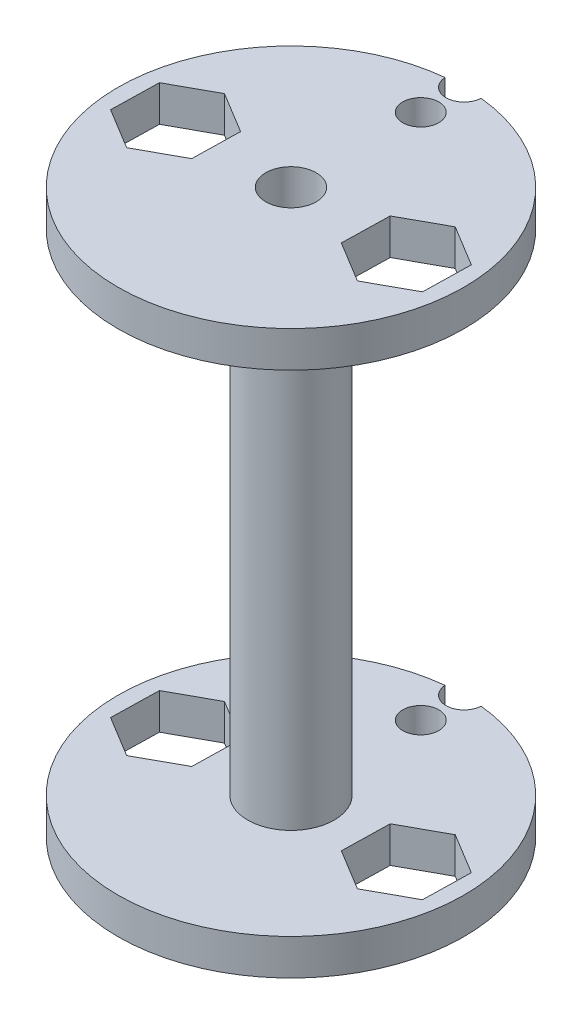
ISO-10303-21;
HEADER;
FILE_DESCRIPTION(('STEP AP214'),'2;1');
FILE_NAME('part.step','',(''),(''),'','','');
FILE_SCHEMA(('AUTOMOTIVE_DESIGN { 1 0 10303 214 1 1 1 1 }'));
ENDSEC;
DATA;
#1=APPLICATION_CONTEXT('core data for automotive mechanical design processes');
#2=APPLICATION_PROTOCOL_DEFINITION('international standard','automotive_design',2000,#1);
#3=PRODUCT_CONTEXT('',#1,'mechanical');
#4=PRODUCT('Part','Part','',(#3));
#5=PRODUCT_RELATED_PRODUCT_CATEGORY('part','',(#4));
#6=PRODUCT_DEFINITION_FORMATION('','',#4);
#7=PRODUCT_DEFINITION_CONTEXT('part definition',#1,'design');
#8=PRODUCT_DEFINITION('design','',#6,#7);
#9=PRODUCT_DEFINITION_SHAPE('','',#8);
#10=(LENGTH_UNIT() NAMED_UNIT(*) SI_UNIT(.MILLI.,.METRE.));
#11=(NAMED_UNIT(*) PLANE_ANGLE_UNIT() SI_UNIT($,.RADIAN.));
#12=(NAMED_UNIT(*) SI_UNIT($,.STERADIAN.) SOLID_ANGLE_UNIT());
#13=UNCERTAINTY_MEASURE_WITH_UNIT(LENGTH_MEASURE(1.E-05),#10,'distance_accuracy_value','');
#14=(GEOMETRIC_REPRESENTATION_CONTEXT(3) GLOBAL_UNCERTAINTY_ASSIGNED_CONTEXT((#13)) GLOBAL_UNIT_ASSIGNED_CONTEXT((#10,
#11,#12)) REPRESENTATION_CONTEXT('',''));
#15=CARTESIAN_POINT('',(0.,0.,0.));
#16=DIRECTION('',(0.,0.,1.));
#17=DIRECTION('',(1.,0.,0.));
#18=AXIS2_PLACEMENT_3D('',#15,#16,#17);
#19=CARTESIAN_POINT('',(0.,2.5,0.));
#20=DIRECTION('',(0.,1.,0.));
#21=DIRECTION('',(0.,0.,1.));
#22=AXIS2_PLACEMENT_3D('',#19,#20,#21);
#23=PLANE('',#22);
#24=DIRECTION('',(-0.0214869779830933,0.,0.999769128237692));
#25=VECTOR('',#24,1.);
#26=CARTESIAN_POINT('',(-5.08999790781407,2.5,-1.59772374233));
#27=LINE('',#26,#25);
#28=CARTESIAN_POINT('',(-5.08999790781407,2.5,-1.59772374233));
#29=VERTEX_POINT('',#28);
#30=CARTESIAN_POINT('',(-5.16132960481908,2.5,1.72127386573417));
#31=VERTEX_POINT('',#30);
#32=EDGE_CURVE('E412',#29,#31,#27,.T.);
#33=ORIENTED_EDGE('',*,*,#32,.T.);
#34=DIRECTION('',(-0.87656895196481,0.,0.48127629533493));
#35=VECTOR('',#34,1.);
#36=CARTESIAN_POINT('',(-5.16132960481908,2.5,1.72127386573417));
#37=LINE('',#36,#35);
#38=CARTESIAN_POINT('',(-8.07133169700495,2.5,3.31899760806487));
#39=VERTEX_POINT('',#38);
#40=EDGE_CURVE('E415',#31,#39,#37,.T.);
#41=ORIENTED_EDGE('',*,*,#40,.T.);
#42=DIRECTION('',(-0.855081973981716,0.,-0.518492832902762));
#43=VECTOR('',#42,1.);
#44=CARTESIAN_POINT('',(-8.07133169700495,2.5,3.31899760806487));
#45=LINE('',#44,#43);
#46=CARTESIAN_POINT('',(-10.9100020921858,2.5,1.59772374233139));
#47=VERTEX_POINT('',#46);
#48=EDGE_CURVE('E419',#39,#47,#45,.T.);
#49=ORIENTED_EDGE('',*,*,#48,.T.);
#50=DIRECTION('',(0.0214869779830943,0.,-0.999769128237692));
#51=VECTOR('',#50,1.);
#52=CARTESIAN_POINT('',(-10.9100020921858,2.5,1.59772374233139));
#53=LINE('',#52,#51);
#54=CARTESIAN_POINT('',(-10.8386703951808,2.5,-1.72127386573279));
#55=VERTEX_POINT('',#54);
#56=EDGE_CURVE('E422',#47,#55,#53,.T.);
#57=ORIENTED_EDGE('',*,*,#56,.T.);
#58=DIRECTION('',(0.87656895196481,0.,-0.48127629533493));
#59=VECTOR('',#58,1.);
#60=CARTESIAN_POINT('',(-10.8386703951808,2.5,-1.72127386573279));
#61=LINE('',#60,#59);
#62=CARTESIAN_POINT('',(-7.92866830299493,2.5,-3.31899760806348));
#63=VERTEX_POINT('',#62);
#64=EDGE_CURVE('E425',#55,#63,#61,.T.);
#65=ORIENTED_EDGE('',*,*,#64,.T.);
#66=DIRECTION('',(0.855081973981716,0.,0.518492832902762));
#67=VECTOR('',#66,1.);
#68=CARTESIAN_POINT('',(-7.92866830299493,2.5,-3.31899760806348));
#69=LINE('',#68,#67);
#70=EDGE_CURVE('E428',#63,#29,#69,.T.);
#71=ORIENTED_EDGE('',*,*,#70,.T.);
#72=EDGE_LOOP('',(#33,#41,#49,#57,#65,#71));
#73=FACE_BOUND('',#72,.T.);
#74=DIRECTION('',(0.0214869779832137,0.,-0.999769128237689));
#75=VECTOR('',#74,1.);
#76=CARTESIAN_POINT('',(5.089997907814,2.5,1.59772374233007));
#77=LINE('',#76,#75);
#78=CARTESIAN_POINT('',(5.089997907814,2.5,1.59772374233007));
#79=VERTEX_POINT('',#78);
#80=CARTESIAN_POINT('',(5.16132960481941,2.5,-1.72127386573409));
#81=VERTEX_POINT('',#80);
#82=EDGE_CURVE('E364',#79,#81,#77,.T.);
#83=ORIENTED_EDGE('',*,*,#82,.T.);
#84=DIRECTION('',(0.876568951964868,0.,-0.481276295334824));
#85=VECTOR('',#84,1.);
#86=CARTESIAN_POINT('',(5.16132960481941,2.5,-1.72127386573409));
#87=LINE('',#86,#85);
#88=CARTESIAN_POINT('',(8.07133169700547,2.5,-3.31899760806444));
#89=VERTEX_POINT('',#88);
#90=EDGE_CURVE('E367',#81,#89,#87,.T.);
#91=ORIENTED_EDGE('',*,*,#90,.T.);
#92=DIRECTION('',(0.855081973981654,0.,0.518492832902865));
#93=VECTOR('',#92,1.);
#94=CARTESIAN_POINT('',(8.07133169700547,2.5,-3.31899760806444));
#95=LINE('',#94,#93);
#96=CARTESIAN_POINT('',(10.9100020921861,2.5,-1.59772374233061));
#97=VERTEX_POINT('',#96);
#98=EDGE_CURVE('E60',#89,#97,#95,.T.);
#99=ORIENTED_EDGE('',*,*,#98,.T.);
#100=DIRECTION('',(-0.021486977983214,0.,0.999769128237689));
#101=VECTOR('',#100,1.);
#102=CARTESIAN_POINT('',(10.9100020921861,2.5,-1.59772374233061));
#103=LINE('',#102,#101);
#104=CARTESIAN_POINT('',(10.8386703951807,2.5,1.72127386573356));
#105=VERTEX_POINT('',#104);
#106=EDGE_CURVE('E372',#97,#105,#103,.T.);
#107=ORIENTED_EDGE('',*,*,#106,.T.);
#108=DIRECTION('',(-0.876568951964868,0.,0.481276295334824));
#109=VECTOR('',#108,1.);
#110=CARTESIAN_POINT('',(10.8386703951807,2.5,1.72127386573356));
#111=LINE('',#110,#109);
#112=CARTESIAN_POINT('',(7.92866830299465,2.5,3.3189976080639));
#113=VERTEX_POINT('',#112);
#114=EDGE_CURVE('E375',#105,#113,#111,.T.);
#115=ORIENTED_EDGE('',*,*,#114,.T.);
#116=DIRECTION('',(-0.855081973981654,0.,-0.518492832902865));
#117=VECTOR('',#116,1.);
#118=CARTESIAN_POINT('',(7.92866830299465,2.5,3.3189976080639));
#119=LINE('',#118,#117);
#120=EDGE_CURVE('E378',#113,#79,#119,.T.);
#121=ORIENTED_EDGE('',*,*,#120,.T.);
#122=EDGE_LOOP('',(#83,#91,#99,#107,#115,#121));
#123=FACE_BOUND('',#122,.T.);
#124=CARTESIAN_POINT('',(0.,2.5,-12.));
#125=DIRECTION('',(0.,1.,0.));
#126=DIRECTION('',(0.,0.,1.));
#127=AXIS2_PLACEMENT_3D('',#124,#125,#126);
#128=CIRCLE('',#127,1.25);
#129=CARTESIAN_POINT('',(-1.24830342764996,2.5,-11.9348958333333));
#130=VERTEX_POINT('',#129);
#131=CARTESIAN_POINT('',(1.24830342764996,2.5,-11.9348958333333));
#132=VERTEX_POINT('',#131);
#133=EDGE_CURVE('E358',#130,#132,#128,.T.);
#134=ORIENTED_EDGE('',*,*,#133,.F.);
#135=CARTESIAN_POINT('',(0.,2.5,0.));
#136=DIRECTION('',(0.,1.,0.));
#137=DIRECTION('',(0.,0.,1.));
#138=AXIS2_PLACEMENT_3D('',#135,#136,#137);
#139=CIRCLE('',#138,12.);
#140=EDGE_CURVE('E462',#130,#132,#139,.T.);
#141=ORIENTED_EDGE('',*,*,#140,.T.);
#142=EDGE_LOOP('',(#134,#141));
#143=FACE_BOUND('',#142,.T.);
#144=CARTESIAN_POINT('',(0.,2.5,-9.));
#145=DIRECTION('',(0.,1.,0.));
#146=DIRECTION('',(0.,0.,1.));
#147=AXIS2_PLACEMENT_3D('',#144,#145,#146);
#148=CIRCLE('',#147,1.25);
#149=CARTESIAN_POINT('',(0.,2.5,-7.75));
#150=VERTEX_POINT('',#149);
#151=EDGE_CURVE('E359',#150,#150,#148,.T.);
#152=ORIENTED_EDGE('',*,*,#151,.F.);
#153=EDGE_LOOP('',(#152));
#154=FACE_BOUND('',#153,.T.);
#155=CARTESIAN_POINT('',(0.,2.5,0.));
#156=DIRECTION('',(0.,1.,0.));
#157=DIRECTION('',(0.,0.,1.));
#158=AXIS2_PLACEMENT_3D('',#155,#156,#157);
#159=CIRCLE('',#158,3.);
#160=CARTESIAN_POINT('',(0.,2.5,3.));
#161=VERTEX_POINT('',#160);
#162=EDGE_CURVE('E232',#161,#161,#159,.T.);
#163=ORIENTED_EDGE('',*,*,#162,.F.);
#164=EDGE_LOOP('',(#163));
#165=FACE_BOUND('',#164,.T.);
#166=ADVANCED_FACE('F36',(#73,#123,#143,#154,#165),#23,.T.);
#167=CARTESIAN_POINT('',(0.,0.,0.));
#168=DIRECTION('',(0.,1.,0.));
#169=DIRECTION('',(0.,0.,1.));
#170=AXIS2_PLACEMENT_3D('',#167,#168,#169);
#171=PLANE('',#170);
#172=CARTESIAN_POINT('',(0.,0.,-9.));
#173=DIRECTION('',(0.,1.,0.));
#174=DIRECTION('',(0.,0.,1.));
#175=AXIS2_PLACEMENT_3D('',#172,#173,#174);
#176=CIRCLE('',#175,1.25);
#177=CARTESIAN_POINT('',(0.,0.,-7.75));
#178=VERTEX_POINT('',#177);
#179=EDGE_CURVE('E40',#178,#178,#176,.T.);
#180=ORIENTED_EDGE('',*,*,#179,.T.);
#181=EDGE_LOOP('',(#180));
#182=FACE_BOUND('',#181,.T.);
#183=DIRECTION('',(0.876568951964868,0.,-0.481276295334824));
#184=VECTOR('',#183,1.);
#185=CARTESIAN_POINT('',(5.16132960481941,0.,-1.72127386573409));
#186=LINE('',#185,#184);
#187=CARTESIAN_POINT('',(5.16132960481941,0.,-1.72127386573409));
#188=VERTEX_POINT('',#187);
#189=CARTESIAN_POINT('',(8.07133169700547,0.,-3.31899760806444));
#190=VERTEX_POINT('',#189);
#191=EDGE_CURVE('E384',#188,#190,#186,.T.);
#192=ORIENTED_EDGE('',*,*,#191,.F.);
#193=DIRECTION('',(0.0214869779832137,0.,-0.999769128237689));
#194=VECTOR('',#193,1.);
#195=CARTESIAN_POINT('',(5.089997907814,0.,1.59772374233007));
#196=LINE('',#195,#194);
#197=CARTESIAN_POINT('',(5.089997907814,0.,1.59772374233007));
#198=VERTEX_POINT('',#197);
#199=EDGE_CURVE('E382',#198,#188,#196,.T.);
#200=ORIENTED_EDGE('',*,*,#199,.F.);
#201=DIRECTION('',(-0.855081973981654,0.,-0.518492832902865));
#202=VECTOR('',#201,1.);
#203=CARTESIAN_POINT('',(7.92866830299465,0.,3.3189976080639));
#204=LINE('',#203,#202);
#205=CARTESIAN_POINT('',(7.92866830299465,0.,3.3189976080639));
#206=VERTEX_POINT('',#205);
#207=EDGE_CURVE('E368',#206,#198,#204,.T.);
#208=ORIENTED_EDGE('',*,*,#207,.F.);
#209=DIRECTION('',(-0.876568951964868,0.,0.481276295334824));
#210=VECTOR('',#209,1.);
#211=CARTESIAN_POINT('',(10.8386703951807,0.,1.72127386573356));
#212=LINE('',#211,#210);
#213=CARTESIAN_POINT('',(10.8386703951807,0.,1.72127386573356));
#214=VERTEX_POINT('',#213);
#215=EDGE_CURVE('E394',#214,#206,#212,.T.);
#216=ORIENTED_EDGE('',*,*,#215,.F.);
#217=DIRECTION('',(-0.021486977983214,0.,0.999769128237689));
#218=VECTOR('',#217,1.);
#219=CARTESIAN_POINT('',(10.9100020921861,0.,-1.59772374233061));
#220=LINE('',#219,#218);
#221=CARTESIAN_POINT('',(10.9100020921861,0.,-1.59772374233061));
#222=VERTEX_POINT('',#221);
#223=EDGE_CURVE('E391',#222,#214,#220,.T.);
#224=ORIENTED_EDGE('',*,*,#223,.F.);
#225=DIRECTION('',(0.855081973981654,0.,0.518492832902865));
#226=VECTOR('',#225,1.);
#227=CARTESIAN_POINT('',(8.07133169700547,0.,-3.31899760806444));
#228=LINE('',#227,#226);
#229=EDGE_CURVE('E388',#190,#222,#228,.T.);
#230=ORIENTED_EDGE('',*,*,#229,.F.);
#231=EDGE_LOOP('',(#192,#200,#208,#216,#224,#230));
#232=FACE_BOUND('',#231,.T.);
#233=DIRECTION('',(-0.87656895196481,0.,0.48127629533493));
#234=VECTOR('',#233,1.);
#235=CARTESIAN_POINT('',(-5.16132960481908,0.,1.72127386573417));
#236=LINE('',#235,#234);
#237=CARTESIAN_POINT('',(-5.16132960481908,0.,1.72127386573417));
#238=VERTEX_POINT('',#237);
#239=CARTESIAN_POINT('',(-8.07133169700495,0.,3.31899760806487));
#240=VERTEX_POINT('',#239);
#241=EDGE_CURVE('E434',#238,#240,#236,.T.);
#242=ORIENTED_EDGE('',*,*,#241,.F.);
#243=DIRECTION('',(-0.0214869779830933,0.,0.999769128237692));
#244=VECTOR('',#243,1.);
#245=CARTESIAN_POINT('',(-5.08999790781407,0.,-1.59772374233));
#246=LINE('',#245,#244);
#247=CARTESIAN_POINT('',(-5.08999790781407,0.,-1.59772374233));
#248=VERTEX_POINT('',#247);
#249=EDGE_CURVE('E432',#248,#238,#246,.T.);
#250=ORIENTED_EDGE('',*,*,#249,.F.);
#251=DIRECTION('',(0.855081973981716,0.,0.518492832902762));
#252=VECTOR('',#251,1.);
#253=CARTESIAN_POINT('',(-7.92866830299493,0.,-3.31899760806348));
#254=LINE('',#253,#252);
#255=CARTESIAN_POINT('',(-7.92866830299493,0.,-3.31899760806348));
#256=VERTEX_POINT('',#255);
#257=EDGE_CURVE('E416',#256,#248,#254,.T.);
#258=ORIENTED_EDGE('',*,*,#257,.F.);
#259=DIRECTION('',(0.87656895196481,0.,-0.48127629533493));
#260=VECTOR('',#259,1.);
#261=CARTESIAN_POINT('',(-10.8386703951808,0.,-1.72127386573279));
#262=LINE('',#261,#260);
#263=CARTESIAN_POINT('',(-10.8386703951808,0.,-1.72127386573279));
#264=VERTEX_POINT('',#263);
#265=EDGE_CURVE('E443',#264,#256,#262,.T.);
#266=ORIENTED_EDGE('',*,*,#265,.F.);
#267=DIRECTION('',(0.0214869779830943,0.,-0.999769128237692));
#268=VECTOR('',#267,1.);
#269=CARTESIAN_POINT('',(-10.9100020921858,0.,1.59772374233139));
#270=LINE('',#269,#268);
#271=CARTESIAN_POINT('',(-10.9100020921858,0.,1.59772374233139));
#272=VERTEX_POINT('',#271);
#273=EDGE_CURVE('E440',#272,#264,#270,.T.);
#274=ORIENTED_EDGE('',*,*,#273,.F.);
#275=DIRECTION('',(-0.855081973981716,0.,-0.518492832902762));
#276=VECTOR('',#275,1.);
#277=CARTESIAN_POINT('',(-8.07133169700495,0.,3.31899760806487));
#278=LINE('',#277,#276);
#279=EDGE_CURVE('E437',#240,#272,#278,.T.);
#280=ORIENTED_EDGE('',*,*,#279,.F.);
#281=EDGE_LOOP('',(#242,#250,#258,#266,#274,#280));
#282=FACE_BOUND('',#281,.T.);
#283=CARTESIAN_POINT('',(0.,0.,0.));
#284=DIRECTION('',(0.,1.,0.));
#285=DIRECTION('',(0.,0.,1.));
#286=AXIS2_PLACEMENT_3D('',#283,#284,#285);
#287=CIRCLE('',#286,12.);
#288=CARTESIAN_POINT('',(-1.24830342764996,0.,-11.9348958333333));
#289=VERTEX_POINT('',#288);
#290=CARTESIAN_POINT('',(1.24830342764998,0.,-11.9348958333333));
#291=VERTEX_POINT('',#290);
#292=EDGE_CURVE('E461',#289,#291,#287,.T.);
#293=ORIENTED_EDGE('',*,*,#292,.F.);
#294=CARTESIAN_POINT('',(0.,0.,-12.));
#295=DIRECTION('',(0.,1.,0.));
#296=DIRECTION('',(0.,0.,1.));
#297=AXIS2_PLACEMENT_3D('',#294,#295,#296);
#298=CIRCLE('',#297,1.25);
#299=EDGE_CURVE('E52',#289,#291,#298,.T.);
#300=ORIENTED_EDGE('',*,*,#299,.T.);
#301=EDGE_LOOP('',(#293,#300));
#302=FACE_BOUND('',#301,.T.);
#303=CARTESIAN_POINT('',(0.,0.,0.));
#304=DIRECTION('',(0.,1.,0.));
#305=DIRECTION('',(0.,0.,1.));
#306=AXIS2_PLACEMENT_3D('',#303,#304,#305);
#307=CIRCLE('',#306,1.75);
#308=CARTESIAN_POINT('',(0.,0.,1.75));
#309=VERTEX_POINT('',#308);
#310=EDGE_CURVE('E401',#309,#309,#307,.T.);
#311=ORIENTED_EDGE('',*,*,#310,.T.);
#312=EDGE_LOOP('',(#311));
#313=FACE_BOUND('',#312,.T.);
#314=ADVANCED_FACE('F472',(#182,#232,#282,#302,#313),#171,.F.);
#315=CARTESIAN_POINT('',(0.,2.5,0.));
#316=DIRECTION('',(0.,-1.,0.));
#317=DIRECTION('',(0.,0.,-1.));
#318=AXIS2_PLACEMENT_3D('',#315,#316,#317);
#319=CYLINDRICAL_SURFACE('',#318,12.);
#320=ORIENTED_EDGE('',*,*,#292,.T.);
#321=DIRECTION('',(0.,1.,0.));
#322=VECTOR('',#321,1.);
#323=CARTESIAN_POINT('',(1.24830342764996,0.,-11.9348958333333));
#324=LINE('',#323,#322);
#325=EDGE_CURVE('E11',#291,#132,#324,.T.);
#326=ORIENTED_EDGE('',*,*,#325,.T.);
#327=ORIENTED_EDGE('',*,*,#140,.F.);
#328=DIRECTION('',(0.,1.,0.));
#329=VECTOR('',#328,1.);
#330=CARTESIAN_POINT('',(-1.24830342764996,0.,-11.9348958333333));
#331=LINE('',#330,#329);
#332=EDGE_CURVE('E45',#130,#289,#331,.F.);
#333=ORIENTED_EDGE('',*,*,#332,.T.);
#334=EDGE_LOOP('',(#320,#326,#327,#333));
#335=FACE_BOUND('',#334,.T.);
#336=ADVANCED_FACE('F38',(#335),#319,.T.);
#337=CARTESIAN_POINT('',(0.,2.5,0.));
#338=DIRECTION('',(0.,-1.,0.));
#339=DIRECTION('',(0.,0.,-1.));
#340=AXIS2_PLACEMENT_3D('',#337,#338,#339);
#341=CYLINDRICAL_SURFACE('',#340,1.75);
#342=ORIENTED_EDGE('',*,*,#310,.F.);
#343=EDGE_LOOP('',(#342));
#344=FACE_BOUND('',#343,.T.);
#345=CARTESIAN_POINT('',(0.,39.,0.));
#346=DIRECTION('',(0.,1.,0.));
#347=DIRECTION('',(0.,0.,1.));
#348=AXIS2_PLACEMENT_3D('',#345,#346,#347);
#349=CIRCLE('',#348,1.75);
#350=CARTESIAN_POINT('',(0.,39.,1.75));
#351=VERTEX_POINT('',#350);
#352=EDGE_CURVE('E293',#351,#351,#349,.T.);
#353=ORIENTED_EDGE('',*,*,#352,.T.);
#354=EDGE_LOOP('',(#353));
#355=FACE_BOUND('',#354,.T.);
#356=ADVANCED_FACE('F478',(#344,#355),#341,.F.);
#357=CARTESIAN_POINT('',(-5.08999790781407,2.5,-1.59772374233));
#358=DIRECTION('',(0.999769128237692,0.,0.0214869779830933));
#359=DIRECTION('',(0.0214869779830933,0.,-0.999769128237692));
#360=AXIS2_PLACEMENT_3D('',#357,#358,#359);
#361=PLANE('',#360);
#362=ORIENTED_EDGE('',*,*,#249,.T.);
#363=DIRECTION('',(0.,-1.,0.));
#364=VECTOR('',#363,1.);
#365=CARTESIAN_POINT('',(-5.16132960481908,2.5,1.72127386573417));
#366=LINE('',#365,#364);
#367=EDGE_CURVE('E431',#31,#238,#366,.T.);
#368=ORIENTED_EDGE('',*,*,#367,.F.);
#369=ORIENTED_EDGE('',*,*,#32,.F.);
#370=DIRECTION('',(0.,-1.,0.));
#371=VECTOR('',#370,1.);
#372=CARTESIAN_POINT('',(-5.08999790781407,2.5,-1.59772374233));
#373=LINE('',#372,#371);
#374=EDGE_CURVE('E385',#29,#248,#373,.T.);
#375=ORIENTED_EDGE('',*,*,#374,.T.);
#376=EDGE_LOOP('',(#362,#368,#369,#375));
#377=FACE_BOUND('',#376,.T.);
#378=ADVANCED_FACE('F481',(#377),#361,.F.);
#379=CARTESIAN_POINT('',(-7.92866830299493,2.5,-3.31899760806348));
#380=DIRECTION('',(0.518492832902762,0.,-0.855081973981716));
#381=DIRECTION('',(-0.855081973981716,0.,-0.518492832902762));
#382=AXIS2_PLACEMENT_3D('',#379,#380,#381);
#383=PLANE('',#382);
#384=ORIENTED_EDGE('',*,*,#257,.T.);
#385=ORIENTED_EDGE('',*,*,#374,.F.);
#386=ORIENTED_EDGE('',*,*,#70,.F.);
#387=DIRECTION('',(0.,-1.,0.));
#388=VECTOR('',#387,1.);
#389=CARTESIAN_POINT('',(-7.92866830299493,2.5,-3.31899760806348));
#390=LINE('',#389,#388);
#391=EDGE_CURVE('E449',#63,#256,#390,.T.);
#392=ORIENTED_EDGE('',*,*,#391,.T.);
#393=EDGE_LOOP('',(#384,#385,#386,#392));
#394=FACE_BOUND('',#393,.T.);
#395=ADVANCED_FACE('F509',(#394),#383,.F.);
#396=CARTESIAN_POINT('',(-10.8386703951808,2.5,-1.72127386573279));
#397=DIRECTION('',(-0.48127629533493,0.,-0.87656895196481));
#398=DIRECTION('',(-0.87656895196481,0.,0.48127629533493));
#399=AXIS2_PLACEMENT_3D('',#396,#397,#398);
#400=PLANE('',#399);
#401=ORIENTED_EDGE('',*,*,#265,.T.);
#402=ORIENTED_EDGE('',*,*,#391,.F.);
#403=ORIENTED_EDGE('',*,*,#64,.F.);
#404=DIRECTION('',(0.,-1.,0.));
#405=VECTOR('',#404,1.);
#406=CARTESIAN_POINT('',(-10.8386703951808,2.5,-1.72127386573279));
#407=LINE('',#406,#405);
#408=EDGE_CURVE('E451',#55,#264,#407,.T.);
#409=ORIENTED_EDGE('',*,*,#408,.T.);
#410=EDGE_LOOP('',(#401,#402,#403,#409));
#411=FACE_BOUND('',#410,.T.);
#412=ADVANCED_FACE('F523',(#411),#400,.F.);
#413=CARTESIAN_POINT('',(-10.9100020921858,2.5,1.59772374233139));
#414=DIRECTION('',(-0.999769128237692,0.,-0.0214869779830943));
#415=DIRECTION('',(-0.0214869779830943,0.,0.999769128237692));
#416=AXIS2_PLACEMENT_3D('',#413,#414,#415);
#417=PLANE('',#416);
#418=ORIENTED_EDGE('',*,*,#273,.T.);
#419=ORIENTED_EDGE('',*,*,#408,.F.);
#420=ORIENTED_EDGE('',*,*,#56,.F.);
#421=DIRECTION('',(0.,-1.,0.));
#422=VECTOR('',#421,1.);
#423=CARTESIAN_POINT('',(-10.9100020921858,2.5,1.59772374233139));
#424=LINE('',#423,#422);
#425=EDGE_CURVE('E453',#47,#272,#424,.T.);
#426=ORIENTED_EDGE('',*,*,#425,.T.);
#427=EDGE_LOOP('',(#418,#419,#420,#426));
#428=FACE_BOUND('',#427,.T.);
#429=ADVANCED_FACE('F519',(#428),#417,.F.);
#430=CARTESIAN_POINT('',(-8.07133169700495,2.5,3.31899760806487));
#431=DIRECTION('',(-0.518492832902762,0.,0.855081973981716));
#432=DIRECTION('',(0.855081973981716,0.,0.518492832902762));
#433=AXIS2_PLACEMENT_3D('',#430,#431,#432);
#434=PLANE('',#433);
#435=ORIENTED_EDGE('',*,*,#279,.T.);
#436=ORIENTED_EDGE('',*,*,#425,.F.);
#437=ORIENTED_EDGE('',*,*,#48,.F.);
#438=DIRECTION('',(0.,-1.,0.));
#439=VECTOR('',#438,1.);
#440=CARTESIAN_POINT('',(-8.07133169700495,2.5,3.31899760806487));
#441=LINE('',#440,#439);
#442=EDGE_CURVE('E455',#39,#240,#441,.T.);
#443=ORIENTED_EDGE('',*,*,#442,.T.);
#444=EDGE_LOOP('',(#435,#436,#437,#443));
#445=FACE_BOUND('',#444,.T.);
#446=ADVANCED_FACE('F515',(#445),#434,.F.);
#447=CARTESIAN_POINT('',(-5.16132960481908,2.5,1.72127386573417));
#448=DIRECTION('',(0.48127629533493,0.,0.87656895196481));
#449=DIRECTION('',(0.87656895196481,0.,-0.48127629533493));
#450=AXIS2_PLACEMENT_3D('',#447,#448,#449);
#451=PLANE('',#450);
#452=ORIENTED_EDGE('',*,*,#241,.T.);
#453=ORIENTED_EDGE('',*,*,#442,.F.);
#454=ORIENTED_EDGE('',*,*,#40,.F.);
#455=ORIENTED_EDGE('',*,*,#367,.T.);
#456=EDGE_LOOP('',(#452,#453,#454,#455));
#457=FACE_BOUND('',#456,.T.);
#458=ADVANCED_FACE('F511',(#457),#451,.F.);
#459=CARTESIAN_POINT('',(5.089997907814,2.5,1.59772374233007));
#460=DIRECTION('',(-0.999769128237689,0.,-0.0214869779832137));
#461=DIRECTION('',(-0.0214869779832137,0.,0.999769128237689));
#462=AXIS2_PLACEMENT_3D('',#459,#460,#461);
#463=PLANE('',#462);
#464=ORIENTED_EDGE('',*,*,#199,.T.);
#465=DIRECTION('',(0.,-1.,0.));
#466=VECTOR('',#465,1.);
#467=CARTESIAN_POINT('',(5.16132960481941,2.5,-1.72127386573409));
#468=LINE('',#467,#466);
#469=EDGE_CURVE('E381',#81,#188,#468,.T.);
#470=ORIENTED_EDGE('',*,*,#469,.F.);
#471=ORIENTED_EDGE('',*,*,#82,.F.);
#472=DIRECTION('',(0.,-1.,0.));
#473=VECTOR('',#472,1.);
#474=CARTESIAN_POINT('',(5.089997907814,2.5,1.59772374233007));
#475=LINE('',#474,#473);
#476=EDGE_CURVE('E399',#79,#198,#475,.T.);
#477=ORIENTED_EDGE('',*,*,#476,.T.);
#478=EDGE_LOOP('',(#464,#470,#471,#477));
#479=FACE_BOUND('',#478,.T.);
#480=ADVANCED_FACE('F514',(#479),#463,.F.);
#481=CARTESIAN_POINT('',(7.92866830299465,2.5,3.3189976080639));
#482=DIRECTION('',(-0.518492832902865,0.,0.855081973981654));
#483=DIRECTION('',(0.855081973981654,0.,0.518492832902865));
#484=AXIS2_PLACEMENT_3D('',#481,#482,#483);
#485=PLANE('',#484);
#486=ORIENTED_EDGE('',*,*,#207,.T.);
#487=ORIENTED_EDGE('',*,*,#476,.F.);
#488=ORIENTED_EDGE('',*,*,#120,.F.);
#489=DIRECTION('',(0.,-1.,0.));
#490=VECTOR('',#489,1.);
#491=CARTESIAN_POINT('',(7.92866830299465,2.5,3.3189976080639));
#492=LINE('',#491,#490);
#493=EDGE_CURVE('E402',#113,#206,#492,.T.);
#494=ORIENTED_EDGE('',*,*,#493,.T.);
#495=EDGE_LOOP('',(#486,#487,#488,#494));
#496=FACE_BOUND('',#495,.T.);
#497=ADVANCED_FACE('F533',(#496),#485,.F.);
#498=CARTESIAN_POINT('',(10.8386703951807,2.5,1.72127386573356));
#499=DIRECTION('',(0.481276295334824,0.,0.876568951964868));
#500=DIRECTION('',(0.876568951964868,0.,-0.481276295334824));
#501=AXIS2_PLACEMENT_3D('',#498,#499,#500);
#502=PLANE('',#501);
#503=ORIENTED_EDGE('',*,*,#215,.T.);
#504=ORIENTED_EDGE('',*,*,#493,.F.);
#505=ORIENTED_EDGE('',*,*,#114,.F.);
#506=DIRECTION('',(0.,-1.,0.));
#507=VECTOR('',#506,1.);
#508=CARTESIAN_POINT('',(10.8386703951807,2.5,1.72127386573356));
#509=LINE('',#508,#507);
#510=EDGE_CURVE('E404',#105,#214,#509,.T.);
#511=ORIENTED_EDGE('',*,*,#510,.T.);
#512=EDGE_LOOP('',(#503,#504,#505,#511));
#513=FACE_BOUND('',#512,.T.);
#514=ADVANCED_FACE('F546',(#513),#502,.F.);
#515=CARTESIAN_POINT('',(10.9100020921861,2.5,-1.59772374233061));
#516=DIRECTION('',(0.999769128237689,0.,0.021486977983214));
#517=DIRECTION('',(0.021486977983214,0.,-0.999769128237689));
#518=AXIS2_PLACEMENT_3D('',#515,#516,#517);
#519=PLANE('',#518);
#520=ORIENTED_EDGE('',*,*,#223,.T.);
#521=ORIENTED_EDGE('',*,*,#510,.F.);
#522=ORIENTED_EDGE('',*,*,#106,.F.);
#523=DIRECTION('',(0.,-1.,0.));
#524=VECTOR('',#523,1.);
#525=CARTESIAN_POINT('',(10.9100020921861,2.5,-1.59772374233061));
#526=LINE('',#525,#524);
#527=EDGE_CURVE('E406',#97,#222,#526,.T.);
#528=ORIENTED_EDGE('',*,*,#527,.T.);
#529=EDGE_LOOP('',(#520,#521,#522,#528));
#530=FACE_BOUND('',#529,.T.);
#531=ADVANCED_FACE('F543',(#530),#519,.F.);
#532=CARTESIAN_POINT('',(8.07133169700547,2.5,-3.31899760806444));
#533=DIRECTION('',(0.518492832902865,0.,-0.855081973981654));
#534=DIRECTION('',(-0.855081973981654,0.,-0.518492832902865));
#535=AXIS2_PLACEMENT_3D('',#532,#533,#534);
#536=PLANE('',#535);
#537=ORIENTED_EDGE('',*,*,#229,.T.);
#538=ORIENTED_EDGE('',*,*,#527,.F.);
#539=ORIENTED_EDGE('',*,*,#98,.F.);
#540=DIRECTION('',(0.,-1.,0.));
#541=VECTOR('',#540,1.);
#542=CARTESIAN_POINT('',(8.07133169700547,2.5,-3.31899760806444));
#543=LINE('',#542,#541);
#544=EDGE_CURVE('E408',#89,#190,#543,.T.);
#545=ORIENTED_EDGE('',*,*,#544,.T.);
#546=EDGE_LOOP('',(#537,#538,#539,#545));
#547=FACE_BOUND('',#546,.T.);
#548=ADVANCED_FACE('F539',(#547),#536,.F.);
#549=CARTESIAN_POINT('',(5.16132960481941,2.5,-1.72127386573409));
#550=DIRECTION('',(-0.481276295334824,0.,-0.876568951964868));
#551=DIRECTION('',(-0.876568951964868,0.,0.481276295334825));
#552=AXIS2_PLACEMENT_3D('',#549,#550,#551);
#553=PLANE('',#552);
#554=ORIENTED_EDGE('',*,*,#191,.T.);
#555=ORIENTED_EDGE('',*,*,#544,.F.);
#556=ORIENTED_EDGE('',*,*,#90,.F.);
#557=ORIENTED_EDGE('',*,*,#469,.T.);
#558=EDGE_LOOP('',(#554,#555,#556,#557));
#559=FACE_BOUND('',#558,.T.);
#560=ADVANCED_FACE('F535',(#559),#553,.F.);
#561=CARTESIAN_POINT('',(0.,-2.5,-12.));
#562=DIRECTION('',(0.,1.,0.));
#563=DIRECTION('',(0.,0.,1.));
#564=AXIS2_PLACEMENT_3D('',#561,#562,#563);
#565=CYLINDRICAL_SURFACE('',#564,1.25);
#566=ORIENTED_EDGE('',*,*,#299,.F.);
#567=ORIENTED_EDGE('',*,*,#332,.F.);
#568=ORIENTED_EDGE('',*,*,#133,.T.);
#569=ORIENTED_EDGE('',*,*,#325,.F.);
#570=EDGE_LOOP('',(#566,#567,#568,#569));
#571=FACE_BOUND('',#570,.T.);
#572=ADVANCED_FACE('F538',(#571),#565,.F.);
#573=CARTESIAN_POINT('',(0.,-2.5,-9.));
#574=DIRECTION('',(0.,1.,0.));
#575=DIRECTION('',(0.,0.,1.));
#576=AXIS2_PLACEMENT_3D('',#573,#574,#575);
#577=CYLINDRICAL_SURFACE('',#576,1.25);
#578=ORIENTED_EDGE('',*,*,#151,.T.);
#579=EDGE_LOOP('',(#578));
#580=FACE_BOUND('',#579,.T.);
#581=ORIENTED_EDGE('',*,*,#179,.F.);
#582=EDGE_LOOP('',(#581));
#583=FACE_BOUND('',#582,.T.);
#584=ADVANCED_FACE('F556',(#580,#583),#577,.F.);
#585=CARTESIAN_POINT('',(0.,19.5,0.));
#586=DIRECTION('',(0.,-1.,0.));
#587=DIRECTION('',(0.,0.,-1.));
#588=AXIS2_PLACEMENT_3D('',#585,#586,#587);
#589=CYLINDRICAL_SURFACE('',#588,3.);
#590=ORIENTED_EDGE('',*,*,#162,.T.);
#591=EDGE_LOOP('',(#590));
#592=FACE_BOUND('',#591,.T.);
#593=CARTESIAN_POINT('',(0.,36.5,0.));
#594=DIRECTION('',(0.,1.,0.));
#595=DIRECTION('',(0.,0.,1.));
#596=AXIS2_PLACEMENT_3D('',#593,#594,#595);
#597=CIRCLE('',#596,3.);
#598=CARTESIAN_POINT('',(0.,36.5,3.));
#599=VERTEX_POINT('',#598);
#600=EDGE_CURVE('E244',#599,#599,#597,.T.);
#601=ORIENTED_EDGE('',*,*,#600,.F.);
#602=EDGE_LOOP('',(#601));
#603=FACE_BOUND('',#602,.T.);
#604=ADVANCED_FACE('F495',(#592,#603),#589,.T.);
#605=CARTESIAN_POINT('',(0.,36.5,0.));
#606=DIRECTION('',(0.,-1.,0.));
#607=DIRECTION('',(0.,0.,1.));
#608=AXIS2_PLACEMENT_3D('',#605,#606,#607);
#609=PLANE('',#608);
#610=DIRECTION('',(-0.0214869779830933,0.,0.999769128237692));
#611=VECTOR('',#610,1.);
#612=CARTESIAN_POINT('',(-5.08999790781407,36.5,-1.59772374233));
#613=LINE('',#612,#611);
#614=CARTESIAN_POINT('',(-5.08999790781407,36.5,-1.59772374233));
#615=VERTEX_POINT('',#614);
#616=CARTESIAN_POINT('',(-5.16132960481908,36.5,1.72127386573417));
#617=VERTEX_POINT('',#616);
#618=EDGE_CURVE('E303',#615,#617,#613,.T.);
#619=ORIENTED_EDGE('',*,*,#618,.F.);
#620=DIRECTION('',(0.855081973981716,0.,0.518492832902762));
#621=VECTOR('',#620,1.);
#622=CARTESIAN_POINT('',(-7.92866830299493,36.5,-3.31899760806348));
#623=LINE('',#622,#621);
#624=CARTESIAN_POINT('',(-7.92866830299493,36.5,-3.31899760806348));
#625=VERTEX_POINT('',#624);
#626=EDGE_CURVE('E319',#625,#615,#623,.T.);
#627=ORIENTED_EDGE('',*,*,#626,.F.);
#628=DIRECTION('',(0.87656895196481,0.,-0.48127629533493));
#629=VECTOR('',#628,1.);
#630=CARTESIAN_POINT('',(-10.8386703951808,36.5,-1.72127386573279));
#631=LINE('',#630,#629);
#632=CARTESIAN_POINT('',(-10.8386703951808,36.5,-1.72127386573279));
#633=VERTEX_POINT('',#632);
#634=EDGE_CURVE('E316',#633,#625,#631,.T.);
#635=ORIENTED_EDGE('',*,*,#634,.F.);
#636=DIRECTION('',(0.0214869779830943,0.,-0.999769128237692));
#637=VECTOR('',#636,1.);
#638=CARTESIAN_POINT('',(-10.9100020921858,36.5,1.59772374233139));
#639=LINE('',#638,#637);
#640=CARTESIAN_POINT('',(-10.9100020921858,36.5,1.59772374233139));
#641=VERTEX_POINT('',#640);
#642=EDGE_CURVE('E313',#641,#633,#639,.T.);
#643=ORIENTED_EDGE('',*,*,#642,.F.);
#644=DIRECTION('',(-0.855081973981716,0.,-0.518492832902762));
#645=VECTOR('',#644,1.);
#646=CARTESIAN_POINT('',(-8.07133169700495,36.5,3.31899760806487));
#647=LINE('',#646,#645);
#648=CARTESIAN_POINT('',(-8.07133169700495,36.5,3.31899760806487));
#649=VERTEX_POINT('',#648);
#650=EDGE_CURVE('E310',#649,#641,#647,.T.);
#651=ORIENTED_EDGE('',*,*,#650,.F.);
#652=DIRECTION('',(-0.87656895196481,0.,0.48127629533493));
#653=VECTOR('',#652,1.);
#654=CARTESIAN_POINT('',(-5.16132960481908,36.5,1.72127386573417));
#655=LINE('',#654,#653);
#656=EDGE_CURVE('E306',#617,#649,#655,.T.);
#657=ORIENTED_EDGE('',*,*,#656,.F.);
#658=EDGE_LOOP('',(#619,#627,#635,#643,#651,#657));
#659=FACE_BOUND('',#658,.T.);
#660=DIRECTION('',(0.0214869779832137,0.,-0.999769128237689));
#661=VECTOR('',#660,1.);
#662=CARTESIAN_POINT('',(5.089997907814,36.5,1.59772374233007));
#663=LINE('',#662,#661);
#664=CARTESIAN_POINT('',(5.089997907814,36.5,1.59772374233007));
#665=VERTEX_POINT('',#664);
#666=CARTESIAN_POINT('',(5.16132960481941,36.5,-1.72127386573409));
#667=VERTEX_POINT('',#666);
#668=EDGE_CURVE('E253',#665,#667,#663,.T.);
#669=ORIENTED_EDGE('',*,*,#668,.F.);
#670=DIRECTION('',(-0.855081973981654,0.,-0.518492832902865));
#671=VECTOR('',#670,1.);
#672=CARTESIAN_POINT('',(7.92866830299465,36.5,3.3189976080639));
#673=LINE('',#672,#671);
#674=CARTESIAN_POINT('',(7.92866830299465,36.5,3.3189976080639));
#675=VERTEX_POINT('',#674);
#676=EDGE_CURVE('E269',#675,#665,#673,.T.);
#677=ORIENTED_EDGE('',*,*,#676,.F.);
#678=DIRECTION('',(-0.876568951964868,0.,0.481276295334824));
#679=VECTOR('',#678,1.);
#680=CARTESIAN_POINT('',(10.8386703951807,36.5,1.72127386573356));
#681=LINE('',#680,#679);
#682=CARTESIAN_POINT('',(10.8386703951807,36.5,1.72127386573356));
#683=VERTEX_POINT('',#682);
#684=EDGE_CURVE('E266',#683,#675,#681,.T.);
#685=ORIENTED_EDGE('',*,*,#684,.F.);
#686=DIRECTION('',(-0.021486977983214,0.,0.999769128237689));
#687=VECTOR('',#686,1.);
#688=CARTESIAN_POINT('',(10.9100020921861,36.5,-1.59772374233061));
#689=LINE('',#688,#687);
#690=CARTESIAN_POINT('',(10.9100020921861,36.5,-1.59772374233061));
#691=VERTEX_POINT('',#690);
#692=EDGE_CURVE('E263',#691,#683,#689,.T.);
#693=ORIENTED_EDGE('',*,*,#692,.F.);
#694=DIRECTION('',(0.855081973981654,0.,0.518492832902865));
#695=VECTOR('',#694,1.);
#696=CARTESIAN_POINT('',(8.07133169700547,36.5,-3.31899760806444));
#697=LINE('',#696,#695);
#698=CARTESIAN_POINT('',(8.07133169700547,36.5,-3.31899760806444));
#699=VERTEX_POINT('',#698);
#700=EDGE_CURVE('E260',#699,#691,#697,.T.);
#701=ORIENTED_EDGE('',*,*,#700,.F.);
#702=DIRECTION('',(0.876568951964868,0.,-0.481276295334824));
#703=VECTOR('',#702,1.);
#704=CARTESIAN_POINT('',(5.16132960481941,36.5,-1.72127386573409));
#705=LINE('',#704,#703);
#706=EDGE_CURVE('E256',#667,#699,#705,.T.);
#707=ORIENTED_EDGE('',*,*,#706,.F.);
#708=EDGE_LOOP('',(#669,#677,#685,#693,#701,#707));
#709=FACE_BOUND('',#708,.T.);
#710=CARTESIAN_POINT('',(0.,36.5,-12.));
#711=DIRECTION('',(0.,1.,0.));
#712=DIRECTION('',(0.,0.,1.));
#713=AXIS2_PLACEMENT_3D('',#710,#711,#712);
#714=CIRCLE('',#713,1.25);
#715=CARTESIAN_POINT('',(-1.24830342764996,36.5,-11.9348958333333));
#716=VERTEX_POINT('',#715);
#717=CARTESIAN_POINT('',(1.24830342764996,36.5,-11.9348958333333));
#718=VERTEX_POINT('',#717);
#719=EDGE_CURVE('E226',#716,#718,#714,.T.);
#720=ORIENTED_EDGE('',*,*,#719,.T.);
#721=CARTESIAN_POINT('',(0.,36.5,0.));
#722=DIRECTION('',(0.,1.,0.));
#723=DIRECTION('',(0.,0.,1.));
#724=AXIS2_PLACEMENT_3D('',#721,#722,#723);
#725=CIRCLE('',#724,12.);
#726=EDGE_CURVE('E236',#716,#718,#725,.T.);
#727=ORIENTED_EDGE('',*,*,#726,.F.);
#728=EDGE_LOOP('',(#720,#727));
#729=FACE_BOUND('',#728,.T.);
#730=CARTESIAN_POINT('',(0.,36.5,-9.));
#731=DIRECTION('',(0.,1.,0.));
#732=DIRECTION('',(0.,0.,1.));
#733=AXIS2_PLACEMENT_3D('',#730,#731,#732);
#734=CIRCLE('',#733,1.25);
#735=CARTESIAN_POINT('',(0.,36.5,-7.75));
#736=VERTEX_POINT('',#735);
#737=EDGE_CURVE('E243',#736,#736,#734,.T.);
#738=ORIENTED_EDGE('',*,*,#737,.T.);
#739=EDGE_LOOP('',(#738));
#740=FACE_BOUND('',#739,.T.);
#741=ORIENTED_EDGE('',*,*,#600,.T.);
#742=EDGE_LOOP('',(#741));
#743=FACE_BOUND('',#742,.T.);
#744=ADVANCED_FACE('F241',(#659,#709,#729,#740,#743),#609,.T.);
#745=CARTESIAN_POINT('',(0.,39.,0.));
#746=DIRECTION('',(0.,-1.,0.));
#747=DIRECTION('',(0.,0.,1.));
#748=AXIS2_PLACEMENT_3D('',#745,#746,#747);
#749=PLANE('',#748);
#750=CARTESIAN_POINT('',(0.,39.,-9.));
#751=DIRECTION('',(0.,1.,0.));
#752=DIRECTION('',(0.,0.,1.));
#753=AXIS2_PLACEMENT_3D('',#750,#751,#752);
#754=CIRCLE('',#753,1.25);
#755=CARTESIAN_POINT('',(0.,39.,-7.75));
#756=VERTEX_POINT('',#755);
#757=EDGE_CURVE('E252',#756,#756,#754,.T.);
#758=ORIENTED_EDGE('',*,*,#757,.F.);
#759=EDGE_LOOP('',(#758));
#760=FACE_BOUND('',#759,.T.);
#761=DIRECTION('',(0.876568951964868,0.,-0.481276295334824));
#762=VECTOR('',#761,1.);
#763=CARTESIAN_POINT('',(5.16132960481941,39.,-1.72127386573409));
#764=LINE('',#763,#762);
#765=CARTESIAN_POINT('',(5.16132960481941,39.,-1.72127386573409));
#766=VERTEX_POINT('',#765);
#767=CARTESIAN_POINT('',(8.07133169700547,39.,-3.31899760806444));
#768=VERTEX_POINT('',#767);
#769=EDGE_CURVE('E276',#766,#768,#764,.T.);
#770=ORIENTED_EDGE('',*,*,#769,.T.);
#771=DIRECTION('',(0.855081973981654,0.,0.518492832902865));
#772=VECTOR('',#771,1.);
#773=CARTESIAN_POINT('',(8.07133169700547,39.,-3.31899760806444));
#774=LINE('',#773,#772);
#775=CARTESIAN_POINT('',(10.9100020921861,39.,-1.59772374233061));
#776=VERTEX_POINT('',#775);
#777=EDGE_CURVE('E280',#768,#776,#774,.T.);
#778=ORIENTED_EDGE('',*,*,#777,.T.);
#779=DIRECTION('',(-0.021486977983214,0.,0.999769128237689));
#780=VECTOR('',#779,1.);
#781=CARTESIAN_POINT('',(10.9100020921861,39.,-1.59772374233061));
#782=LINE('',#781,#780);
#783=CARTESIAN_POINT('',(10.8386703951807,39.,1.72127386573356));
#784=VERTEX_POINT('',#783);
#785=EDGE_CURVE('E283',#776,#784,#782,.T.);
#786=ORIENTED_EDGE('',*,*,#785,.T.);
#787=DIRECTION('',(-0.876568951964868,0.,0.481276295334824));
#788=VECTOR('',#787,1.);
#789=CARTESIAN_POINT('',(10.8386703951807,39.,1.72127386573356));
#790=LINE('',#789,#788);
#791=CARTESIAN_POINT('',(7.92866830299465,39.,3.3189976080639));
#792=VERTEX_POINT('',#791);
#793=EDGE_CURVE('E286',#784,#792,#790,.T.);
#794=ORIENTED_EDGE('',*,*,#793,.T.);
#795=DIRECTION('',(-0.855081973981654,0.,-0.518492832902865));
#796=VECTOR('',#795,1.);
#797=CARTESIAN_POINT('',(7.92866830299465,39.,3.3189976080639));
#798=LINE('',#797,#796);
#799=CARTESIAN_POINT('',(5.089997907814,39.,1.59772374233007));
#800=VERTEX_POINT('',#799);
#801=EDGE_CURVE('E257',#792,#800,#798,.T.);
#802=ORIENTED_EDGE('',*,*,#801,.T.);
#803=DIRECTION('',(0.0214869779832137,0.,-0.999769128237689));
#804=VECTOR('',#803,1.);
#805=CARTESIAN_POINT('',(5.089997907814,39.,1.59772374233007));
#806=LINE('',#805,#804);
#807=EDGE_CURVE('E273',#800,#766,#806,.T.);
#808=ORIENTED_EDGE('',*,*,#807,.T.);
#809=EDGE_LOOP('',(#770,#778,#786,#794,#802,#808));
#810=FACE_BOUND('',#809,.T.);
#811=DIRECTION('',(-0.87656895196481,0.,0.48127629533493));
#812=VECTOR('',#811,1.);
#813=CARTESIAN_POINT('',(-5.16132960481908,39.,1.72127386573417));
#814=LINE('',#813,#812);
#815=CARTESIAN_POINT('',(-5.16132960481908,39.,1.72127386573417));
#816=VERTEX_POINT('',#815);
#817=CARTESIAN_POINT('',(-8.07133169700495,39.,3.31899760806487));
#818=VERTEX_POINT('',#817);
#819=EDGE_CURVE('E326',#816,#818,#814,.T.);
#820=ORIENTED_EDGE('',*,*,#819,.T.);
#821=DIRECTION('',(-0.855081973981716,0.,-0.518492832902762));
#822=VECTOR('',#821,1.);
#823=CARTESIAN_POINT('',(-8.07133169700495,39.,3.31899760806487));
#824=LINE('',#823,#822);
#825=CARTESIAN_POINT('',(-10.9100020921858,39.,1.59772374233139));
#826=VERTEX_POINT('',#825);
#827=EDGE_CURVE('E329',#818,#826,#824,.T.);
#828=ORIENTED_EDGE('',*,*,#827,.T.);
#829=DIRECTION('',(0.0214869779830943,0.,-0.999769128237692));
#830=VECTOR('',#829,1.);
#831=CARTESIAN_POINT('',(-10.9100020921858,39.,1.59772374233139));
#832=LINE('',#831,#830);
#833=CARTESIAN_POINT('',(-10.8386703951808,39.,-1.72127386573279));
#834=VERTEX_POINT('',#833);
#835=EDGE_CURVE('E332',#826,#834,#832,.T.);
#836=ORIENTED_EDGE('',*,*,#835,.T.);
#837=DIRECTION('',(0.87656895196481,0.,-0.48127629533493));
#838=VECTOR('',#837,1.);
#839=CARTESIAN_POINT('',(-10.8386703951808,39.,-1.72127386573279));
#840=LINE('',#839,#838);
#841=CARTESIAN_POINT('',(-7.92866830299493,39.,-3.31899760806348));
#842=VERTEX_POINT('',#841);
#843=EDGE_CURVE('E335',#834,#842,#840,.T.);
#844=ORIENTED_EDGE('',*,*,#843,.T.);
#845=DIRECTION('',(0.855081973981716,0.,0.518492832902762));
#846=VECTOR('',#845,1.);
#847=CARTESIAN_POINT('',(-7.92866830299493,39.,-3.31899760806348));
#848=LINE('',#847,#846);
#849=CARTESIAN_POINT('',(-5.08999790781407,39.,-1.59772374233));
#850=VERTEX_POINT('',#849);
#851=EDGE_CURVE('E307',#842,#850,#848,.T.);
#852=ORIENTED_EDGE('',*,*,#851,.T.);
#853=DIRECTION('',(-0.0214869779830933,0.,0.999769128237692));
#854=VECTOR('',#853,1.);
#855=CARTESIAN_POINT('',(-5.08999790781407,39.,-1.59772374233));
#856=LINE('',#855,#854);
#857=EDGE_CURVE('E323',#850,#816,#856,.T.);
#858=ORIENTED_EDGE('',*,*,#857,.T.);
#859=EDGE_LOOP('',(#820,#828,#836,#844,#852,#858));
#860=FACE_BOUND('',#859,.T.);
#861=CARTESIAN_POINT('',(0.,39.,0.));
#862=DIRECTION('',(0.,1.,0.));
#863=DIRECTION('',(0.,0.,1.));
#864=AXIS2_PLACEMENT_3D('',#861,#862,#863);
#865=CIRCLE('',#864,12.);
#866=CARTESIAN_POINT('',(-1.24830342764996,39.,-11.9348958333333));
#867=VERTEX_POINT('',#866);
#868=CARTESIAN_POINT('',(1.24830342764998,39.,-11.9348958333333));
#869=VERTEX_POINT('',#868);
#870=EDGE_CURVE('E239',#867,#869,#865,.T.);
#871=ORIENTED_EDGE('',*,*,#870,.T.);
#872=CARTESIAN_POINT('',(0.,39.,-12.));
#873=DIRECTION('',(0.,1.,0.));
#874=DIRECTION('',(0.,0.,1.));
#875=AXIS2_PLACEMENT_3D('',#872,#873,#874);
#876=CIRCLE('',#875,1.25);
#877=EDGE_CURVE('E228',#867,#869,#876,.T.);
#878=ORIENTED_EDGE('',*,*,#877,.F.);
#879=EDGE_LOOP('',(#871,#878));
#880=FACE_BOUND('',#879,.T.);
#881=ORIENTED_EDGE('',*,*,#352,.F.);
#882=EDGE_LOOP('',(#881));
#883=FACE_BOUND('',#882,.T.);
#884=ADVANCED_FACE('F485',(#760,#810,#860,#880,#883),#749,.F.);
#885=CARTESIAN_POINT('',(0.,36.5,0.));
#886=DIRECTION('',(0.,1.,0.));
#887=DIRECTION('',(0.,0.,-1.));
#888=AXIS2_PLACEMENT_3D('',#885,#886,#887);
#889=CYLINDRICAL_SURFACE('',#888,12.);
#890=ORIENTED_EDGE('',*,*,#870,.F.);
#891=DIRECTION('',(0.,-1.,0.));
#892=VECTOR('',#891,1.);
#893=CARTESIAN_POINT('',(-1.24830342764996,39.,-11.9348958333333));
#894=LINE('',#893,#892);
#895=EDGE_CURVE('E233',#716,#867,#894,.F.);
#896=ORIENTED_EDGE('',*,*,#895,.F.);
#897=ORIENTED_EDGE('',*,*,#726,.T.);
#898=DIRECTION('',(0.,-1.,0.));
#899=VECTOR('',#898,1.);
#900=CARTESIAN_POINT('',(1.24830342764996,39.,-11.9348958333333));
#901=LINE('',#900,#899);
#902=EDGE_CURVE('E222',#869,#718,#901,.T.);
#903=ORIENTED_EDGE('',*,*,#902,.F.);
#904=EDGE_LOOP('',(#890,#896,#897,#903));
#905=FACE_BOUND('',#904,.T.);
#906=ADVANCED_FACE('F237',(#905),#889,.T.);
#907=CARTESIAN_POINT('',(-5.08999790781407,36.5,-1.59772374233));
#908=DIRECTION('',(0.999769128237692,0.,0.0214869779830933));
#909=DIRECTION('',(0.0214869779830933,0.,-0.999769128237692));
#910=AXIS2_PLACEMENT_3D('',#907,#908,#909);
#911=PLANE('',#910);
#912=ORIENTED_EDGE('',*,*,#857,.F.);
#913=DIRECTION('',(0.,1.,0.));
#914=VECTOR('',#913,1.);
#915=CARTESIAN_POINT('',(-5.08999790781407,36.5,-1.59772374233));
#916=LINE('',#915,#914);
#917=EDGE_CURVE('E277',#615,#850,#916,.T.);
#918=ORIENTED_EDGE('',*,*,#917,.F.);
#919=ORIENTED_EDGE('',*,*,#618,.T.);
#920=DIRECTION('',(0.,1.,0.));
#921=VECTOR('',#920,1.);
#922=CARTESIAN_POINT('',(-5.16132960481908,36.5,1.72127386573417));
#923=LINE('',#922,#921);
#924=EDGE_CURVE('E322',#617,#816,#923,.T.);
#925=ORIENTED_EDGE('',*,*,#924,.T.);
#926=EDGE_LOOP('',(#912,#918,#919,#925));
#927=FACE_BOUND('',#926,.T.);
#928=ADVANCED_FACE('F493',(#927),#911,.F.);
#929=CARTESIAN_POINT('',(-7.92866830299493,36.5,-3.31899760806348));
#930=DIRECTION('',(0.518492832902762,0.,-0.855081973981716));
#931=DIRECTION('',(-0.855081973981716,0.,-0.518492832902762));
#932=AXIS2_PLACEMENT_3D('',#929,#930,#931);
#933=PLANE('',#932);
#934=ORIENTED_EDGE('',*,*,#851,.F.);
#935=DIRECTION('',(0.,1.,0.));
#936=VECTOR('',#935,1.);
#937=CARTESIAN_POINT('',(-7.92866830299493,36.5,-3.31899760806348));
#938=LINE('',#937,#936);
#939=EDGE_CURVE('E341',#625,#842,#938,.T.);
#940=ORIENTED_EDGE('',*,*,#939,.F.);
#941=ORIENTED_EDGE('',*,*,#626,.T.);
#942=ORIENTED_EDGE('',*,*,#917,.T.);
#943=EDGE_LOOP('',(#934,#940,#941,#942));
#944=FACE_BOUND('',#943,.T.);
#945=ADVANCED_FACE('F595',(#944),#933,.F.);
#946=CARTESIAN_POINT('',(-10.8386703951808,36.5,-1.72127386573279));
#947=DIRECTION('',(-0.48127629533493,0.,-0.87656895196481));
#948=DIRECTION('',(-0.87656895196481,0.,0.48127629533493));
#949=AXIS2_PLACEMENT_3D('',#946,#947,#948);
#950=PLANE('',#949);
#951=ORIENTED_EDGE('',*,*,#843,.F.);
#952=DIRECTION('',(0.,1.,0.));
#953=VECTOR('',#952,1.);
#954=CARTESIAN_POINT('',(-10.8386703951808,36.5,-1.72127386573279));
#955=LINE('',#954,#953);
#956=EDGE_CURVE('E343',#633,#834,#955,.T.);
#957=ORIENTED_EDGE('',*,*,#956,.F.);
#958=ORIENTED_EDGE('',*,*,#634,.T.);
#959=ORIENTED_EDGE('',*,*,#939,.T.);
#960=EDGE_LOOP('',(#951,#957,#958,#959));
#961=FACE_BOUND('',#960,.T.);
#962=ADVANCED_FACE('F605',(#961),#950,.F.);
#963=CARTESIAN_POINT('',(-10.9100020921858,36.5,1.59772374233139));
#964=DIRECTION('',(-0.999769128237692,0.,-0.0214869779830943));
#965=DIRECTION('',(-0.0214869779830943,0.,0.999769128237692));
#966=AXIS2_PLACEMENT_3D('',#963,#964,#965);
#967=PLANE('',#966);
#968=ORIENTED_EDGE('',*,*,#835,.F.);
#969=DIRECTION('',(0.,1.,0.));
#970=VECTOR('',#969,1.);
#971=CARTESIAN_POINT('',(-10.9100020921858,36.5,1.59772374233139));
#972=LINE('',#971,#970);
#973=EDGE_CURVE('E345',#641,#826,#972,.T.);
#974=ORIENTED_EDGE('',*,*,#973,.F.);
#975=ORIENTED_EDGE('',*,*,#642,.T.);
#976=ORIENTED_EDGE('',*,*,#956,.T.);
#977=EDGE_LOOP('',(#968,#974,#975,#976));
#978=FACE_BOUND('',#977,.T.);
#979=ADVANCED_FACE('F615',(#978),#967,.F.);
#980=CARTESIAN_POINT('',(-8.07133169700495,36.5,3.31899760806487));
#981=DIRECTION('',(-0.518492832902762,0.,0.855081973981716));
#982=DIRECTION('',(0.855081973981716,0.,0.518492832902762));
#983=AXIS2_PLACEMENT_3D('',#980,#981,#982);
#984=PLANE('',#983);
#985=ORIENTED_EDGE('',*,*,#827,.F.);
#986=DIRECTION('',(0.,1.,0.));
#987=VECTOR('',#986,1.);
#988=CARTESIAN_POINT('',(-8.07133169700495,36.5,3.31899760806487));
#989=LINE('',#988,#987);
#990=EDGE_CURVE('E347',#649,#818,#989,.T.);
#991=ORIENTED_EDGE('',*,*,#990,.F.);
#992=ORIENTED_EDGE('',*,*,#650,.T.);
#993=ORIENTED_EDGE('',*,*,#973,.T.);
#994=EDGE_LOOP('',(#985,#991,#992,#993));
#995=FACE_BOUND('',#994,.T.);
#996=ADVANCED_FACE('F625',(#995),#984,.F.);
#997=CARTESIAN_POINT('',(-5.16132960481908,36.5,1.72127386573417));
#998=DIRECTION('',(0.48127629533493,0.,0.87656895196481));
#999=DIRECTION('',(0.87656895196481,0.,-0.48127629533493));
#1000=AXIS2_PLACEMENT_3D('',#997,#998,#999);
#1001=PLANE('',#1000);
#1002=ORIENTED_EDGE('',*,*,#819,.F.);
#1003=ORIENTED_EDGE('',*,*,#924,.F.);
#1004=ORIENTED_EDGE('',*,*,#656,.T.);
#1005=ORIENTED_EDGE('',*,*,#990,.T.);
#1006=EDGE_LOOP('',(#1002,#1003,#1004,#1005));
#1007=FACE_BOUND('',#1006,.T.);
#1008=ADVANCED_FACE('F635',(#1007),#1001,.F.);
#1009=CARTESIAN_POINT('',(5.089997907814,36.5,1.59772374233007));
#1010=DIRECTION('',(-0.999769128237689,0.,-0.0214869779832137));
#1011=DIRECTION('',(-0.0214869779832137,0.,0.999769128237689));
#1012=AXIS2_PLACEMENT_3D('',#1009,#1010,#1011);
#1013=PLANE('',#1012);
#1014=ORIENTED_EDGE('',*,*,#807,.F.);
#1015=DIRECTION('',(0.,1.,0.));
#1016=VECTOR('',#1015,1.);
#1017=CARTESIAN_POINT('',(5.089997907814,36.5,1.59772374233007));
#1018=LINE('',#1017,#1016);
#1019=EDGE_CURVE('E291',#665,#800,#1018,.T.);
#1020=ORIENTED_EDGE('',*,*,#1019,.F.);
#1021=ORIENTED_EDGE('',*,*,#668,.T.);
#1022=DIRECTION('',(0.,1.,0.));
#1023=VECTOR('',#1022,1.);
#1024=CARTESIAN_POINT('',(5.16132960481941,36.5,-1.72127386573409));
#1025=LINE('',#1024,#1023);
#1026=EDGE_CURVE('E272',#667,#766,#1025,.T.);
#1027=ORIENTED_EDGE('',*,*,#1026,.T.);
#1028=EDGE_LOOP('',(#1014,#1020,#1021,#1027));
#1029=FACE_BOUND('',#1028,.T.);
#1030=ADVANCED_FACE('F645',(#1029),#1013,.F.);
#1031=CARTESIAN_POINT('',(7.92866830299465,36.5,3.3189976080639));
#1032=DIRECTION('',(-0.518492832902865,0.,0.855081973981654));
#1033=DIRECTION('',(0.855081973981654,0.,0.518492832902865));
#1034=AXIS2_PLACEMENT_3D('',#1031,#1032,#1033);
#1035=PLANE('',#1034);
#1036=ORIENTED_EDGE('',*,*,#801,.F.);
#1037=DIRECTION('',(0.,1.,0.));
#1038=VECTOR('',#1037,1.);
#1039=CARTESIAN_POINT('',(7.92866830299465,36.5,3.3189976080639));
#1040=LINE('',#1039,#1038);
#1041=EDGE_CURVE('E294',#675,#792,#1040,.T.);
#1042=ORIENTED_EDGE('',*,*,#1041,.F.);
#1043=ORIENTED_EDGE('',*,*,#676,.T.);
#1044=ORIENTED_EDGE('',*,*,#1019,.T.);
#1045=EDGE_LOOP('',(#1036,#1042,#1043,#1044));
#1046=FACE_BOUND('',#1045,.T.);
#1047=ADVANCED_FACE('F655',(#1046),#1035,.F.);
#1048=CARTESIAN_POINT('',(10.8386703951807,36.5,1.72127386573356));
#1049=DIRECTION('',(0.481276295334824,0.,0.876568951964868));
#1050=DIRECTION('',(0.876568951964868,0.,-0.481276295334824));
#1051=AXIS2_PLACEMENT_3D('',#1048,#1049,#1050);
#1052=PLANE('',#1051);
#1053=ORIENTED_EDGE('',*,*,#793,.F.);
#1054=DIRECTION('',(0.,1.,0.));
#1055=VECTOR('',#1054,1.);
#1056=CARTESIAN_POINT('',(10.8386703951807,36.5,1.72127386573356));
#1057=LINE('',#1056,#1055);
#1058=EDGE_CURVE('E296',#683,#784,#1057,.T.);
#1059=ORIENTED_EDGE('',*,*,#1058,.F.);
#1060=ORIENTED_EDGE('',*,*,#684,.T.);
#1061=ORIENTED_EDGE('',*,*,#1041,.T.);
#1062=EDGE_LOOP('',(#1053,#1059,#1060,#1061));
#1063=FACE_BOUND('',#1062,.T.);
#1064=ADVANCED_FACE('F665',(#1063),#1052,.F.);
#1065=CARTESIAN_POINT('',(10.9100020921861,36.5,-1.59772374233061));
#1066=DIRECTION('',(0.999769128237689,0.,0.021486977983214));
#1067=DIRECTION('',(0.021486977983214,0.,-0.999769128237689));
#1068=AXIS2_PLACEMENT_3D('',#1065,#1066,#1067);
#1069=PLANE('',#1068);
#1070=ORIENTED_EDGE('',*,*,#785,.F.);
#1071=DIRECTION('',(0.,1.,0.));
#1072=VECTOR('',#1071,1.);
#1073=CARTESIAN_POINT('',(10.9100020921861,36.5,-1.59772374233061));
#1074=LINE('',#1073,#1072);
#1075=EDGE_CURVE('E298',#691,#776,#1074,.T.);
#1076=ORIENTED_EDGE('',*,*,#1075,.F.);
#1077=ORIENTED_EDGE('',*,*,#692,.T.);
#1078=ORIENTED_EDGE('',*,*,#1058,.T.);
#1079=EDGE_LOOP('',(#1070,#1076,#1077,#1078));
#1080=FACE_BOUND('',#1079,.T.);
#1081=ADVANCED_FACE('F675',(#1080),#1069,.F.);
#1082=CARTESIAN_POINT('',(8.07133169700547,36.5,-3.31899760806444));
#1083=DIRECTION('',(0.518492832902865,0.,-0.855081973981654));
#1084=DIRECTION('',(-0.855081973981654,0.,-0.518492832902865));
#1085=AXIS2_PLACEMENT_3D('',#1082,#1083,#1084);
#1086=PLANE('',#1085);
#1087=ORIENTED_EDGE('',*,*,#777,.F.);
#1088=DIRECTION('',(0.,1.,0.));
#1089=VECTOR('',#1088,1.);
#1090=CARTESIAN_POINT('',(8.07133169700547,36.5,-3.31899760806444));
#1091=LINE('',#1090,#1089);
#1092=EDGE_CURVE('E300',#699,#768,#1091,.T.);
#1093=ORIENTED_EDGE('',*,*,#1092,.F.);
#1094=ORIENTED_EDGE('',*,*,#700,.T.);
#1095=ORIENTED_EDGE('',*,*,#1075,.T.);
#1096=EDGE_LOOP('',(#1087,#1093,#1094,#1095));
#1097=FACE_BOUND('',#1096,.T.);
#1098=ADVANCED_FACE('F685',(#1097),#1086,.F.);
#1099=CARTESIAN_POINT('',(5.16132960481941,36.5,-1.72127386573409));
#1100=DIRECTION('',(-0.481276295334824,0.,-0.876568951964868));
#1101=DIRECTION('',(-0.876568951964868,0.,0.481276295334825));
#1102=AXIS2_PLACEMENT_3D('',#1099,#1100,#1101);
#1103=PLANE('',#1102);
#1104=ORIENTED_EDGE('',*,*,#769,.F.);
#1105=ORIENTED_EDGE('',*,*,#1026,.F.);
#1106=ORIENTED_EDGE('',*,*,#706,.T.);
#1107=ORIENTED_EDGE('',*,*,#1092,.T.);
#1108=EDGE_LOOP('',(#1104,#1105,#1106,#1107));
#1109=FACE_BOUND('',#1108,.T.);
#1110=ADVANCED_FACE('F695',(#1109),#1103,.F.);
#1111=CARTESIAN_POINT('',(0.,41.5,-12.));
#1112=DIRECTION('',(0.,-1.,0.));
#1113=DIRECTION('',(0.,0.,1.));
#1114=AXIS2_PLACEMENT_3D('',#1111,#1112,#1113);
#1115=CYLINDRICAL_SURFACE('',#1114,1.25);
#1116=ORIENTED_EDGE('',*,*,#877,.T.);
#1117=ORIENTED_EDGE('',*,*,#902,.T.);
#1118=ORIENTED_EDGE('',*,*,#719,.F.);
#1119=ORIENTED_EDGE('',*,*,#895,.T.);
#1120=EDGE_LOOP('',(#1116,#1117,#1118,#1119));
#1121=FACE_BOUND('',#1120,.T.);
#1122=ADVANCED_FACE('F224',(#1121),#1115,.F.);
#1123=CARTESIAN_POINT('',(0.,41.5,-9.));
#1124=DIRECTION('',(0.,-1.,0.));
#1125=DIRECTION('',(0.,0.,1.));
#1126=AXIS2_PLACEMENT_3D('',#1123,#1124,#1125);
#1127=CYLINDRICAL_SURFACE('',#1126,1.25);
#1128=ORIENTED_EDGE('',*,*,#737,.F.);
#1129=EDGE_LOOP('',(#1128));
#1130=FACE_BOUND('',#1129,.T.);
#1131=ORIENTED_EDGE('',*,*,#757,.T.);
#1132=EDGE_LOOP('',(#1131));
#1133=FACE_BOUND('',#1132,.T.);
#1134=ADVANCED_FACE('F714',(#1130,#1133),#1127,.F.);
#1135=CLOSED_SHELL('',(#166,#314,#336,#356,#378,#395,#412,#429,#446,#458,#480,#497,#514,#531,
#548,#560,#572,#584,#604,#744,#884,#906,#928,#945,#962,#979,#996,#1008,#1030,#1047,#1064,#1081,
#1098,#1110,#1122,#1134));
#1136=MANIFOLD_SOLID_BREP('B2',#1135);
#1137=ADVANCED_BREP_SHAPE_REPRESENTATION('',(#18,#1136),#14);
#1138=SHAPE_DEFINITION_REPRESENTATION(#9,#1137);
ENDSEC;
END-ISO-10303-21;
